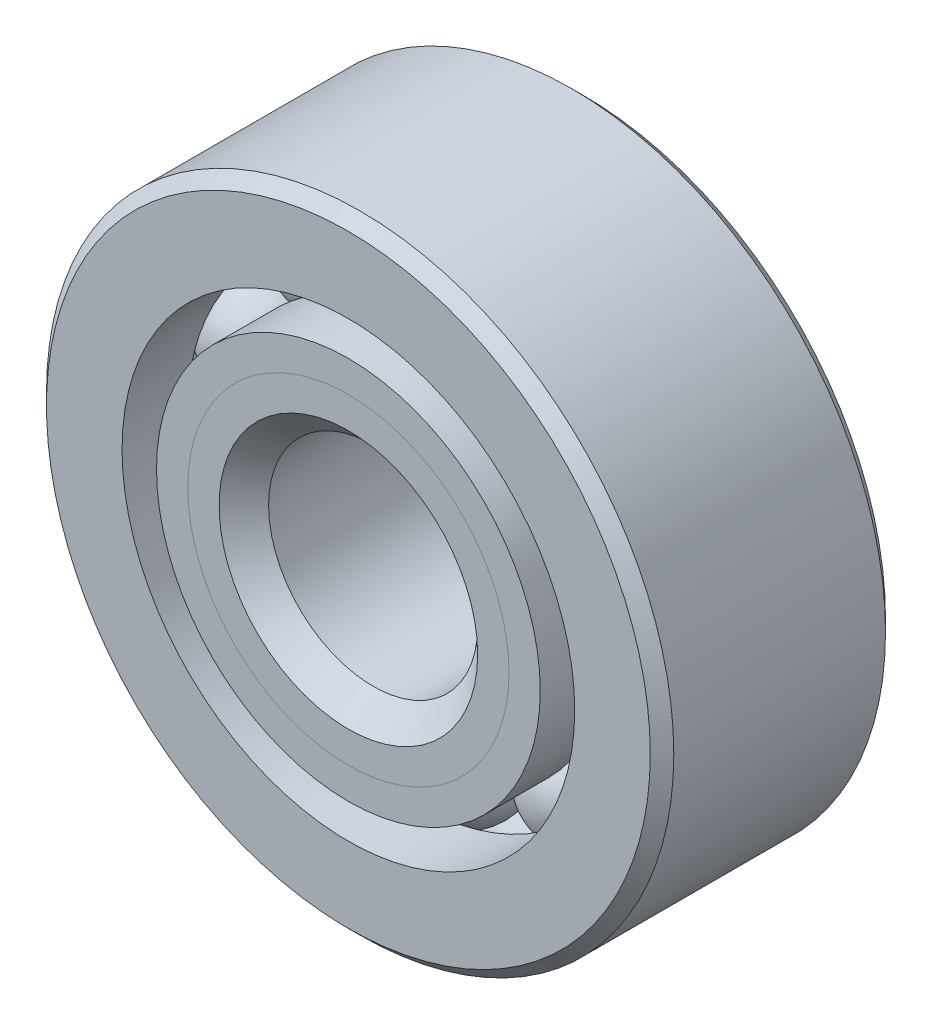
ISO-10303-21;
HEADER;
FILE_DESCRIPTION(('STEP AP214'),'2;1');
FILE_NAME('part.step','',(''),(''),'','','');
FILE_SCHEMA(('AUTOMOTIVE_DESIGN { 1 0 10303 214 1 1 1 1 }'));
ENDSEC;
DATA;
#1=APPLICATION_CONTEXT('core data for automotive mechanical design processes');
#2=APPLICATION_PROTOCOL_DEFINITION('international standard','automotive_design',2000,#1);
#3=PRODUCT_CONTEXT('',#1,'mechanical');
#4=PRODUCT('Part','Part','',(#3));
#5=PRODUCT_RELATED_PRODUCT_CATEGORY('part','',(#4));
#6=PRODUCT_DEFINITION_FORMATION('','',#4);
#7=PRODUCT_DEFINITION_CONTEXT('part definition',#1,'design');
#8=PRODUCT_DEFINITION('design','',#6,#7);
#9=PRODUCT_DEFINITION_SHAPE('','',#8);
#10=(LENGTH_UNIT() NAMED_UNIT(*) SI_UNIT(.MILLI.,.METRE.));
#11=(NAMED_UNIT(*) PLANE_ANGLE_UNIT() SI_UNIT($,.RADIAN.));
#12=(NAMED_UNIT(*) SI_UNIT($,.STERADIAN.) SOLID_ANGLE_UNIT());
#13=UNCERTAINTY_MEASURE_WITH_UNIT(LENGTH_MEASURE(1.E-05),#10,'distance_accuracy_value','');
#14=(GEOMETRIC_REPRESENTATION_CONTEXT(3) GLOBAL_UNCERTAINTY_ASSIGNED_CONTEXT((#13)) GLOBAL_UNIT_ASSIGNED_CONTEXT((#10,
#11,#12)) REPRESENTATION_CONTEXT('',''));
#15=CARTESIAN_POINT('',(0.,0.,0.));
#16=DIRECTION('',(0.,0.,1.));
#17=DIRECTION('',(1.,0.,0.));
#18=AXIS2_PLACEMENT_3D('',#15,#16,#17);
#19=CARTESIAN_POINT('',(-3.73243635205716,5.13725791428081,0.));
#20=DIRECTION('',(0.,0.,1.));
#21=DIRECTION('',(-0.587785252292462,0.809016994374955,0.));
#22=AXIS2_PLACEMENT_3D('',#19,#20,#21);
#23=SPHERICAL_SURFACE('',#22,1.67154216154795);
#24=CARTESIAN_POINT('',(-3.73243635205716,5.13725791428081,1.67154216154795));
#25=VERTEX_POINT('',#24);
#26=VERTEX_LOOP('',#25);
#27=FACE_BOUND('',#26,.T.);
#28=ADVANCED_FACE('F41',(#27),#23,.T.);
#29=CLOSED_SHELL('',(#28));
#30=MANIFOLD_SOLID_BREP('B2',#29);
#31=CARTESIAN_POINT('',(-6.03920887847421,1.96225791428098,0.));
#32=DIRECTION('',(0.,0.,1.));
#33=DIRECTION('',(-0.95105651629515,0.309016994374958,0.));
#34=AXIS2_PLACEMENT_3D('',#31,#32,#33);
#35=SPHERICAL_SURFACE('',#34,1.67154216154795);
#36=CARTESIAN_POINT('',(-6.03920887847421,1.96225791428098,1.67154216154795));
#37=VERTEX_POINT('',#36);
#38=VERTEX_LOOP('',#37);
#39=FACE_BOUND('',#38,.T.);
#40=ADVANCED_FACE('F110',(#39),#35,.T.);
#41=CLOSED_SHELL('',(#40));
#42=MANIFOLD_SOLID_BREP('B6',#41);
#43=CARTESIAN_POINT('',(-6.03920887847425,-1.96225791428085,6.66133814775094E-13));
#44=DIRECTION('',(0.,0.,1.));
#45=DIRECTION('',(-0.951056516295157,-0.309016994374938,0.));
#46=AXIS2_PLACEMENT_3D('',#43,#44,#45);
#47=SPHERICAL_SURFACE('',#46,1.67154216154795);
#48=CARTESIAN_POINT('',(-6.03920887847425,-1.96225791428085,1.67154216154861));
#49=VERTEX_POINT('',#48);
#50=VERTEX_LOOP('',#49);
#51=FACE_BOUND('',#50,.T.);
#52=ADVANCED_FACE('F179',(#51),#47,.T.);
#53=CLOSED_SHELL('',(#52));
#54=MANIFOLD_SOLID_BREP('B37',#53);
#55=CARTESIAN_POINT('',(-3.73243635205725,-5.13725791428103,6.52256026967279E-13));
#56=DIRECTION('',(0.,0.,1.));
#57=DIRECTION('',(-0.58778525229248,-0.809016994374942,0.));
#58=AXIS2_PLACEMENT_3D('',#55,#56,#57);
#59=SPHERICAL_SURFACE('',#58,1.67154216154795);
#60=CARTESIAN_POINT('',(-3.73243635205725,-5.13725791428103,1.6715421615486));
#61=VERTEX_POINT('',#60);
#62=VERTEX_LOOP('',#61);
#63=FACE_BOUND('',#62,.T.);
#64=ADVANCED_FACE('F248',(#63),#59,.T.);
#65=CLOSED_SHELL('',(#64));
#66=MANIFOLD_SOLID_BREP('B106',#65);
#67=CARTESIAN_POINT('',(0.,-6.34999999999999,0.));
#68=DIRECTION('',(0.,0.,1.));
#69=DIRECTION('',(0.,-1.,0.));
#70=AXIS2_PLACEMENT_3D('',#67,#68,#69);
#71=SPHERICAL_SURFACE('',#70,1.67154216154795);
#72=CARTESIAN_POINT('',(0.,-6.34999999999999,1.67154216154795));
#73=VERTEX_POINT('',#72);
#74=VERTEX_LOOP('',#73);
#75=FACE_BOUND('',#74,.T.);
#76=ADVANCED_FACE('F317',(#75),#71,.T.);
#77=CLOSED_SHELL('',(#76));
#78=MANIFOLD_SOLID_BREP('B175',#77);
#79=CARTESIAN_POINT('',(3.73243635205716,-5.13725791428094,6.52256026967279E-13));
#80=DIRECTION('',(0.,0.,1.));
#81=DIRECTION('',(0.587785252292469,-0.809016994374951,0.));
#82=AXIS2_PLACEMENT_3D('',#79,#80,#81);
#83=SPHERICAL_SURFACE('',#82,1.67154216154795);
#84=CARTESIAN_POINT('',(3.73243635205716,-5.13725791428094,1.6715421615486));
#85=VERTEX_POINT('',#84);
#86=VERTEX_LOOP('',#85);
#87=FACE_BOUND('',#86,.T.);
#88=ADVANCED_FACE('F386',(#87),#83,.T.);
#89=CLOSED_SHELL('',(#88));
#90=MANIFOLD_SOLID_BREP('B244',#89);
#91=CARTESIAN_POINT('',(6.03920887847421,-1.96225791428124,6.66133814775094E-13));
#92=DIRECTION('',(0.,0.,1.));
#93=DIRECTION('',(0.951056516295152,-0.309016994374952,0.));
#94=AXIS2_PLACEMENT_3D('',#91,#92,#93);
#95=SPHERICAL_SURFACE('',#94,1.67154216154795);
#96=CARTESIAN_POINT('',(6.03920887847421,-1.96225791428124,1.67154216154861));
#97=VERTEX_POINT('',#96);
#98=VERTEX_LOOP('',#97);
#99=FACE_BOUND('',#98,.T.);
#100=ADVANCED_FACE('F455',(#99),#95,.T.);
#101=CLOSED_SHELL('',(#100));
#102=MANIFOLD_SOLID_BREP('B313',#101);
#103=CARTESIAN_POINT('',(6.0392088784742,1.96225791428059,0.));
#104=DIRECTION('',(0.,0.,1.));
#105=DIRECTION('',(0.951056516295155,0.309016994374945,0.));
#106=AXIS2_PLACEMENT_3D('',#103,#104,#105);
#107=SPHERICAL_SURFACE('',#106,1.67154216154795);
#108=CARTESIAN_POINT('',(6.0392088784742,1.96225791428059,1.67154216154795));
#109=VERTEX_POINT('',#108);
#110=VERTEX_LOOP('',#109);
#111=FACE_BOUND('',#110,.T.);
#112=ADVANCED_FACE('F524',(#111),#107,.T.);
#113=CLOSED_SHELL('',(#112));
#114=MANIFOLD_SOLID_BREP('B382',#113);
#115=CARTESIAN_POINT('',(3.73243635205721,5.13725791428091,0.));
#116=DIRECTION('',(0.,0.,1.));
#117=DIRECTION('',(0.587785252292474,0.809016994374947,0.));
#118=AXIS2_PLACEMENT_3D('',#115,#116,#117);
#119=SPHERICAL_SURFACE('',#118,1.67154216154795);
#120=CARTESIAN_POINT('',(3.73243635205721,5.13725791428091,1.67154216154795));
#121=VERTEX_POINT('',#120);
#122=VERTEX_LOOP('',#121);
#123=FACE_BOUND('',#122,.T.);
#124=ADVANCED_FACE('F593',(#123),#119,.T.);
#125=CLOSED_SHELL('',(#124));
#126=MANIFOLD_SOLID_BREP('B451',#125);
#127=CARTESIAN_POINT('',(0.,6.34999999999999,6.93889390390723E-13));
#128=DIRECTION('',(0.,0.,1.));
#129=DIRECTION('',(0.,1.,0.));
#130=AXIS2_PLACEMENT_3D('',#127,#128,#129);
#131=SPHERICAL_SURFACE('',#130,1.67154216154795);
#132=CARTESIAN_POINT('',(0.,6.34999999999999,1.67154216154864));
#133=VERTEX_POINT('',#132);
#134=VERTEX_LOOP('',#133);
#135=FACE_BOUND('',#134,.T.);
#136=ADVANCED_FACE('F664',(#135),#131,.T.);
#137=CLOSED_SHELL('',(#136));
#138=MANIFOLD_SOLID_BREP('B520',#137);
#139=CARTESIAN_POINT('',(0.,4.87668863543704,3.57187499999999));
#140=DIRECTION('',(0.,0.,-1.));
#141=DIRECTION('',(-1.,0.,0.));
#142=AXIS2_PLACEMENT_3D('',#139,#140,#141);
#143=PLANE('',#142);
#144=CARTESIAN_POINT('',(0.,-1.52655665885959E-13,3.571875));
#145=DIRECTION('',(0.,0.,1.));
#146=DIRECTION('',(1.,0.,0.));
#147=AXIS2_PLACEMENT_3D('',#144,#145,#146);
#148=CIRCLE('',#147,3.92672891922603);
#149=CARTESIAN_POINT('',(3.92672891922603,-1.52655665885959E-13,3.571875));
#150=VERTEX_POINT('',#149);
#151=EDGE_CURVE('E718',#150,#150,#148,.T.);
#152=ORIENTED_EDGE('',*,*,#151,.F.);
#153=EDGE_LOOP('',(#152));
#154=FACE_BOUND('',#153,.T.);
#155=CARTESIAN_POINT('',(0.,-1.52655665885959E-13,3.571875));
#156=DIRECTION('',(0.,0.,1.));
#157=DIRECTION('',(1.,0.,0.));
#158=AXIS2_PLACEMENT_3D('',#155,#156,#157);
#159=CIRCLE('',#158,4.87668863543719);
#160=CARTESIAN_POINT('',(4.87668863543719,-1.52655665885959E-13,3.571875));
#161=VERTEX_POINT('',#160);
#162=EDGE_CURVE('E663',#161,#161,#159,.T.);
#163=ORIENTED_EDGE('',*,*,#162,.T.);
#164=EDGE_LOOP('',(#163));
#165=FACE_BOUND('',#164,.T.);
#166=ADVANCED_FACE('F684',(#154,#165),#143,.F.);
#167=CARTESIAN_POINT('',(0.,1.80411241501588E-13,2.62191528378883));
#168=DIRECTION('',(0.,0.,1.));
#169=DIRECTION('',(1.,0.,0.));
#170=AXIS2_PLACEMENT_3D('',#167,#168,#169);
#171=CONICAL_SURFACE('',#170,3.92672891922603,0.78539816339745);
#172=ORIENTED_EDGE('',*,*,#162,.F.);
#173=EDGE_LOOP('',(#172));
#174=FACE_BOUND('',#173,.T.);
#175=CARTESIAN_POINT('',(0.,1.80411241501588E-13,2.62191528378883));
#176=DIRECTION('',(0.,0.,1.));
#177=DIRECTION('',(1.,0.,0.));
#178=AXIS2_PLACEMENT_3D('',#175,#176,#177);
#179=CIRCLE('',#178,3.92672891922603);
#180=CARTESIAN_POINT('',(3.92672891922603,1.80411241501588E-13,2.62191528378883));
#181=VERTEX_POINT('',#180);
#182=EDGE_CURVE('E690',#181,#181,#179,.T.);
#183=ORIENTED_EDGE('',*,*,#182,.T.);
#184=EDGE_LOOP('',(#183));
#185=FACE_BOUND('',#184,.T.);
#186=ADVANCED_FACE('F725',(#174,#185),#171,.T.);
#187=CARTESIAN_POINT('',(0.,-1.52655665885959E-13,3.571875));
#188=DIRECTION('',(0.,0.,1.));
#189=DIRECTION('',(1.,0.,0.));
#190=AXIS2_PLACEMENT_3D('',#187,#188,#189);
#191=CYLINDRICAL_SURFACE('',#190,3.92672891922603);
#192=ORIENTED_EDGE('',*,*,#182,.F.);
#193=EDGE_LOOP('',(#192));
#194=FACE_BOUND('',#193,.T.);
#195=CARTESIAN_POINT('',(0.,0.,0.));
#196=DIRECTION('',(0.,0.,1.));
#197=DIRECTION('',(1.,0.,0.));
#198=AXIS2_PLACEMENT_3D('',#195,#196,#197);
#199=CIRCLE('',#198,3.92672891922603);
#200=CARTESIAN_POINT('',(3.92672891922603,0.,0.));
#201=VERTEX_POINT('',#200);
#202=EDGE_CURVE('E694',#201,#201,#199,.T.);
#203=ORIENTED_EDGE('',*,*,#202,.T.);
#204=EDGE_LOOP('',(#203));
#205=FACE_BOUND('',#204,.T.);
#206=ADVANCED_FACE('F729',(#194,#205),#191,.T.);
#207=CARTESIAN_POINT('',(0.,3.92672891922602,0.));
#208=DIRECTION('',(0.,0.,-1.));
#209=DIRECTION('',(-1.,0.,0.));
#210=AXIS2_PLACEMENT_3D('',#207,#208,#209);
#211=PLANE('',#210);
#212=ORIENTED_EDGE('',*,*,#202,.F.);
#213=EDGE_LOOP('',(#212));
#214=FACE_BOUND('',#213,.T.);
#215=CARTESIAN_POINT('',(0.,0.,0.));
#216=DIRECTION('',(0.,0.,1.));
#217=DIRECTION('',(1.,0.,0.));
#218=AXIS2_PLACEMENT_3D('',#215,#216,#217);
#219=CIRCLE('',#218,4.67845783845205);
#220=CARTESIAN_POINT('',(4.67845783845205,0.,0.));
#221=VERTEX_POINT('',#220);
#222=EDGE_CURVE('E698',#221,#221,#219,.T.);
#223=ORIENTED_EDGE('',*,*,#222,.T.);
#224=EDGE_LOOP('',(#223));
#225=FACE_BOUND('',#224,.T.);
#226=ADVANCED_FACE('F734',(#214,#225),#211,.F.);
#227=CARTESIAN_POINT('',(0.,0.,0.));
#228=DIRECTION('',(0.,0.,1.));
#229=DIRECTION('',(1.,0.,0.));
#230=AXIS2_PLACEMENT_3D('',#227,#228,#229);
#231=TOROIDAL_SURFACE('',#230,6.35,1.67154216154795);
#232=ORIENTED_EDGE('',*,*,#222,.F.);
#233=EDGE_LOOP('',(#232));
#234=FACE_BOUND('',#233,.T.);
#235=CARTESIAN_POINT('',(0.,0.,-1.58749999999996));
#236=DIRECTION('',(0.,0.,1.));
#237=DIRECTION('',(1.,0.,0.));
#238=AXIS2_PLACEMENT_3D('',#235,#236,#237);
#239=CIRCLE('',#238,5.82664835164835);
#240=CARTESIAN_POINT('',(5.82664835164835,0.,-1.58749999999996));
#241=VERTEX_POINT('',#240);
#242=EDGE_CURVE('E703',#241,#241,#239,.T.);
#243=ORIENTED_EDGE('',*,*,#242,.T.);
#244=EDGE_LOOP('',(#243));
#245=FACE_BOUND('',#244,.T.);
#246=ADVANCED_FACE('F740',(#234,#245),#231,.F.);
#247=CARTESIAN_POINT('',(0.,-1.52655665885959E-13,3.571875));
#248=DIRECTION('',(0.,0.,1.));
#249=DIRECTION('',(1.,0.,0.));
#250=AXIS2_PLACEMENT_3D('',#247,#248,#249);
#251=CYLINDRICAL_SURFACE('',#250,5.82664835164835);
#252=ORIENTED_EDGE('',*,*,#242,.F.);
#253=EDGE_LOOP('',(#252));
#254=FACE_BOUND('',#253,.T.);
#255=CARTESIAN_POINT('',(0.,0.,-3.57187499999997));
#256=DIRECTION('',(0.,0.,1.));
#257=DIRECTION('',(1.,0.,0.));
#258=AXIS2_PLACEMENT_3D('',#255,#256,#257);
#259=CIRCLE('',#258,5.82664835164835);
#260=CARTESIAN_POINT('',(5.82664835164835,0.,-3.57187499999997));
#261=VERTEX_POINT('',#260);
#262=EDGE_CURVE('E706',#261,#261,#259,.T.);
#263=ORIENTED_EDGE('',*,*,#262,.T.);
#264=EDGE_LOOP('',(#263));
#265=FACE_BOUND('',#264,.T.);
#266=ADVANCED_FACE('F744',(#254,#265),#251,.T.);
#267=CARTESIAN_POINT('',(0.,3.53218750000002,-3.57187499999997));
#268=DIRECTION('',(0.,0.,1.));
#269=DIRECTION('',(1.,0.,0.));
#270=AXIS2_PLACEMENT_3D('',#267,#268,#269);
#271=PLANE('',#270);
#272=ORIENTED_EDGE('',*,*,#262,.F.);
#273=EDGE_LOOP('',(#272));
#274=FACE_BOUND('',#273,.T.);
#275=CARTESIAN_POINT('',(0.,0.,-3.57187499999997));
#276=DIRECTION('',(0.,0.,1.));
#277=DIRECTION('',(1.,0.,0.));
#278=AXIS2_PLACEMENT_3D('',#275,#276,#277);
#279=CIRCLE('',#278,3.5321875);
#280=CARTESIAN_POINT('',(3.5321875,0.,-3.57187499999997));
#281=VERTEX_POINT('',#280);
#282=EDGE_CURVE('E709',#281,#281,#279,.T.);
#283=ORIENTED_EDGE('',*,*,#282,.T.);
#284=EDGE_LOOP('',(#283));
#285=FACE_BOUND('',#284,.T.);
#286=ADVANCED_FACE('F748',(#274,#285),#271,.F.);
#287=CARTESIAN_POINT('',(0.,1.94289029309402E-13,-3.21468749999998));
#288=DIRECTION('',(0.,0.,-1.));
#289=DIRECTION('',(-1.,0.,0.));
#290=AXIS2_PLACEMENT_3D('',#287,#288,#289);
#291=CONICAL_SURFACE('',#290,3.175,0.785398163397446);
#292=ORIENTED_EDGE('',*,*,#282,.F.);
#293=EDGE_LOOP('',(#292));
#294=FACE_BOUND('',#293,.T.);
#295=CARTESIAN_POINT('',(0.,1.94289029309402E-13,-3.21468749999998));
#296=DIRECTION('',(0.,0.,1.));
#297=DIRECTION('',(1.,0.,0.));
#298=AXIS2_PLACEMENT_3D('',#295,#296,#297);
#299=CIRCLE('',#298,3.175);
#300=CARTESIAN_POINT('',(3.175,1.94289029309402E-13,-3.21468749999998));
#301=VERTEX_POINT('',#300);
#302=EDGE_CURVE('E712',#301,#301,#299,.T.);
#303=ORIENTED_EDGE('',*,*,#302,.T.);
#304=EDGE_LOOP('',(#303));
#305=FACE_BOUND('',#304,.T.);
#306=ADVANCED_FACE('F752',(#294,#305),#291,.F.);
#307=CARTESIAN_POINT('',(0.,-1.52655665885959E-13,3.571875));
#308=DIRECTION('',(0.,0.,1.));
#309=DIRECTION('',(1.,0.,0.));
#310=AXIS2_PLACEMENT_3D('',#307,#308,#309);
#311=CYLINDRICAL_SURFACE('',#310,3.175);
#312=ORIENTED_EDGE('',*,*,#302,.F.);
#313=EDGE_LOOP('',(#312));
#314=FACE_BOUND('',#313,.T.);
#315=CARTESIAN_POINT('',(0.,1.94289029309402E-13,2.82014608077397));
#316=DIRECTION('',(0.,0.,1.));
#317=DIRECTION('',(1.,0.,0.));
#318=AXIS2_PLACEMENT_3D('',#315,#316,#317);
#319=CIRCLE('',#318,3.175);
#320=CARTESIAN_POINT('',(3.175,1.94289029309402E-13,2.82014608077397));
#321=VERTEX_POINT('',#320);
#322=EDGE_CURVE('E715',#321,#321,#319,.T.);
#323=ORIENTED_EDGE('',*,*,#322,.T.);
#324=EDGE_LOOP('',(#323));
#325=FACE_BOUND('',#324,.T.);
#326=ADVANCED_FACE('F756',(#314,#325),#311,.F.);
#327=CARTESIAN_POINT('',(0.,-1.52655665885959E-13,3.571875));
#328=DIRECTION('',(0.,0.,1.));
#329=DIRECTION('',(1.,0.,0.));
#330=AXIS2_PLACEMENT_3D('',#327,#328,#329);
#331=CONICAL_SURFACE('',#330,3.92672891922603,0.78539816339745);
#332=ORIENTED_EDGE('',*,*,#322,.F.);
#333=EDGE_LOOP('',(#332));
#334=FACE_BOUND('',#333,.T.);
#335=ORIENTED_EDGE('',*,*,#151,.T.);
#336=EDGE_LOOP('',(#335));
#337=FACE_BOUND('',#336,.T.);
#338=ADVANCED_FACE('F722',(#334,#337),#331,.F.);
#339=CLOSED_SHELL('',(#166,#186,#206,#226,#246,#266,#286,#306,#326,#338));
#340=MANIFOLD_SOLID_BREP('B589',#339);
#341=CARTESIAN_POINT('',(0.,5.8266483516482,3.571875));
#342=DIRECTION('',(0.,0.,-1.));
#343=DIRECTION('',(-1.,0.,0.));
#344=AXIS2_PLACEMENT_3D('',#341,#342,#343);
#345=PLANE('',#344);
#346=CARTESIAN_POINT('',(0.,-1.52655665885959E-13,3.571875));
#347=DIRECTION('',(0.,0.,1.));
#348=DIRECTION('',(1.,0.,0.));
#349=AXIS2_PLACEMENT_3D('',#346,#347,#348);
#350=CIRCLE('',#349,4.87668863543719);
#351=CARTESIAN_POINT('',(4.87668863543719,-1.52655665885959E-13,3.571875));
#352=VERTEX_POINT('',#351);
#353=EDGE_CURVE('E683',#352,#352,#350,.T.);
#354=ORIENTED_EDGE('',*,*,#353,.F.);
#355=EDGE_LOOP('',(#354));
#356=FACE_BOUND('',#355,.T.);
#357=CARTESIAN_POINT('',(0.,-1.52655665885959E-13,3.571875));
#358=DIRECTION('',(0.,0.,1.));
#359=DIRECTION('',(1.,0.,0.));
#360=AXIS2_PLACEMENT_3D('',#357,#358,#359);
#361=CIRCLE('',#360,5.82664835164835);
#362=CARTESIAN_POINT('',(5.82664835164835,-1.52655665885959E-13,3.571875));
#363=VERTEX_POINT('',#362);
#364=EDGE_CURVE('E864',#363,#363,#361,.T.);
#365=ORIENTED_EDGE('',*,*,#364,.T.);
#366=EDGE_LOOP('',(#365));
#367=FACE_BOUND('',#366,.T.);
#368=ADVANCED_FACE('F842',(#356,#367),#345,.F.);
#369=CARTESIAN_POINT('',(0.,-1.52655665885959E-13,3.571875));
#370=DIRECTION('',(0.,0.,1.));
#371=DIRECTION('',(1.,0.,0.));
#372=AXIS2_PLACEMENT_3D('',#369,#370,#371);
#373=CONICAL_SURFACE('',#372,4.87668863543719,0.78539816339745);
#374=CARTESIAN_POINT('',(0.,1.80411241501588E-13,2.62191528378883));
#375=DIRECTION('',(0.,0.,1.));
#376=DIRECTION('',(1.,0.,0.));
#377=AXIS2_PLACEMENT_3D('',#374,#375,#376);
#378=CIRCLE('',#377,3.92672891922603);
#379=CARTESIAN_POINT('',(3.92672891922603,1.80411241501588E-13,2.62191528378883));
#380=VERTEX_POINT('',#379);
#381=EDGE_CURVE('E848',#380,#380,#378,.T.);
#382=ORIENTED_EDGE('',*,*,#381,.F.);
#383=EDGE_LOOP('',(#382));
#384=FACE_BOUND('',#383,.T.);
#385=ORIENTED_EDGE('',*,*,#353,.T.);
#386=EDGE_LOOP('',(#385));
#387=FACE_BOUND('',#386,.T.);
#388=ADVANCED_FACE('F889',(#384,#387),#373,.F.);
#389=CARTESIAN_POINT('',(0.,-1.52655665885959E-13,3.571875));
#390=DIRECTION('',(0.,0.,1.));
#391=DIRECTION('',(1.,0.,0.));
#392=AXIS2_PLACEMENT_3D('',#389,#390,#391);
#393=CYLINDRICAL_SURFACE('',#392,3.92672891922603);
#394=CARTESIAN_POINT('',(0.,0.,0.));
#395=DIRECTION('',(0.,0.,1.));
#396=DIRECTION('',(1.,0.,0.));
#397=AXIS2_PLACEMENT_3D('',#394,#395,#396);
#398=CIRCLE('',#397,3.92672891922603);
#399=CARTESIAN_POINT('',(3.92672891922603,0.,0.));
#400=VERTEX_POINT('',#399);
#401=EDGE_CURVE('E852',#400,#400,#398,.T.);
#402=ORIENTED_EDGE('',*,*,#401,.F.);
#403=EDGE_LOOP('',(#402));
#404=FACE_BOUND('',#403,.T.);
#405=ORIENTED_EDGE('',*,*,#381,.T.);
#406=EDGE_LOOP('',(#405));
#407=FACE_BOUND('',#406,.T.);
#408=ADVANCED_FACE('F884',(#404,#407),#393,.F.);
#409=CARTESIAN_POINT('',(0.,3.92672891922602,0.));
#410=DIRECTION('',(0.,0.,1.));
#411=DIRECTION('',(1.,0.,0.));
#412=AXIS2_PLACEMENT_3D('',#409,#410,#411);
#413=PLANE('',#412);
#414=CARTESIAN_POINT('',(0.,0.,0.));
#415=DIRECTION('',(0.,0.,1.));
#416=DIRECTION('',(1.,0.,0.));
#417=AXIS2_PLACEMENT_3D('',#414,#415,#416);
#418=CIRCLE('',#417,4.67845783845205);
#419=CARTESIAN_POINT('',(4.67845783845205,0.,0.));
#420=VERTEX_POINT('',#419);
#421=EDGE_CURVE('E856',#420,#420,#418,.T.);
#422=ORIENTED_EDGE('',*,*,#421,.F.);
#423=EDGE_LOOP('',(#422));
#424=FACE_BOUND('',#423,.T.);
#425=ORIENTED_EDGE('',*,*,#401,.T.);
#426=EDGE_LOOP('',(#425));
#427=FACE_BOUND('',#426,.T.);
#428=ADVANCED_FACE('F878',(#424,#427),#413,.F.);
#429=CARTESIAN_POINT('',(0.,0.,0.));
#430=DIRECTION('',(0.,0.,1.));
#431=DIRECTION('',(1.,0.,0.));
#432=AXIS2_PLACEMENT_3D('',#429,#430,#431);
#433=TOROIDAL_SURFACE('',#432,6.35,1.67154216154795);
#434=CARTESIAN_POINT('',(0.,0.,1.58749999999999));
#435=DIRECTION('',(0.,0.,1.));
#436=DIRECTION('',(1.,0.,0.));
#437=AXIS2_PLACEMENT_3D('',#434,#435,#436);
#438=CIRCLE('',#437,5.82664835164835);
#439=CARTESIAN_POINT('',(5.82664835164835,0.,1.58749999999999));
#440=VERTEX_POINT('',#439);
#441=EDGE_CURVE('E861',#440,#440,#438,.T.);
#442=ORIENTED_EDGE('',*,*,#441,.F.);
#443=EDGE_LOOP('',(#442));
#444=FACE_BOUND('',#443,.T.);
#445=ORIENTED_EDGE('',*,*,#421,.T.);
#446=EDGE_LOOP('',(#445));
#447=FACE_BOUND('',#446,.T.);
#448=ADVANCED_FACE('F872',(#444,#447),#433,.F.);
#449=CARTESIAN_POINT('',(0.,-1.52655665885959E-13,3.571875));
#450=DIRECTION('',(0.,0.,1.));
#451=DIRECTION('',(1.,0.,0.));
#452=AXIS2_PLACEMENT_3D('',#449,#450,#451);
#453=CYLINDRICAL_SURFACE('',#452,5.82664835164835);
#454=ORIENTED_EDGE('',*,*,#364,.F.);
#455=EDGE_LOOP('',(#454));
#456=FACE_BOUND('',#455,.T.);
#457=ORIENTED_EDGE('',*,*,#441,.T.);
#458=EDGE_LOOP('',(#457));
#459=FACE_BOUND('',#458,.T.);
#460=ADVANCED_FACE('F869',(#456,#459),#453,.T.);
#461=CLOSED_SHELL('',(#368,#388,#408,#428,#448,#460));
#462=MANIFOLD_SOLID_BREP('B658',#461);
#463=CARTESIAN_POINT('',(0.,-1.52655665885959E-13,3.21468750000001));
#464=DIRECTION('',(0.,0.,-1.));
#465=DIRECTION('',(-1.,0.,0.));
#466=AXIS2_PLACEMENT_3D('',#463,#464,#465);
#467=CONICAL_SURFACE('',#466,9.525,0.785398163397446);
#468=CARTESIAN_POINT('',(0.,-1.52655665885959E-13,3.571875));
#469=DIRECTION('',(0.,0.,1.));
#470=DIRECTION('',(1.,0.,0.));
#471=AXIS2_PLACEMENT_3D('',#468,#469,#470);
#472=CIRCLE('',#471,9.1678125);
#473=CARTESIAN_POINT('',(9.1678125,-1.52655665885959E-13,3.571875));
#474=VERTEX_POINT('',#473);
#475=EDGE_CURVE('E961',#474,#474,#472,.T.);
#476=ORIENTED_EDGE('',*,*,#475,.F.);
#477=EDGE_LOOP('',(#476));
#478=FACE_BOUND('',#477,.T.);
#479=CARTESIAN_POINT('',(0.,-1.52655665885959E-13,3.21468750000001));
#480=DIRECTION('',(0.,0.,1.));
#481=DIRECTION('',(1.,0.,0.));
#482=AXIS2_PLACEMENT_3D('',#479,#480,#481);
#483=CIRCLE('',#482,9.525);
#484=CARTESIAN_POINT('',(9.525,-1.52655665885959E-13,3.21468750000001));
#485=VERTEX_POINT('',#484);
#486=EDGE_CURVE('E841',#485,#485,#483,.T.);
#487=ORIENTED_EDGE('',*,*,#486,.T.);
#488=EDGE_LOOP('',(#487));
#489=FACE_BOUND('',#488,.T.);
#490=ADVANCED_FACE('F933',(#478,#489),#467,.T.);
#491=CARTESIAN_POINT('',(0.,-1.52655665885959E-13,3.571875));
#492=DIRECTION('',(0.,0.,1.));
#493=DIRECTION('',(1.,0.,0.));
#494=AXIS2_PLACEMENT_3D('',#491,#492,#493);
#495=CYLINDRICAL_SURFACE('',#494,9.525);
#496=ORIENTED_EDGE('',*,*,#486,.F.);
#497=EDGE_LOOP('',(#496));
#498=FACE_BOUND('',#497,.T.);
#499=CARTESIAN_POINT('',(0.,1.94289029309402E-13,-3.21468749999998));
#500=DIRECTION('',(0.,0.,1.));
#501=DIRECTION('',(1.,0.,0.));
#502=AXIS2_PLACEMENT_3D('',#499,#500,#501);
#503=CIRCLE('',#502,9.525);
#504=CARTESIAN_POINT('',(9.525,1.94289029309402E-13,-3.21468749999998));
#505=VERTEX_POINT('',#504);
#506=EDGE_CURVE('E939',#505,#505,#503,.T.);
#507=ORIENTED_EDGE('',*,*,#506,.T.);
#508=EDGE_LOOP('',(#507));
#509=FACE_BOUND('',#508,.T.);
#510=ADVANCED_FACE('F968',(#498,#509),#495,.T.);
#511=CARTESIAN_POINT('',(0.,0.,-3.57187499999997));
#512=DIRECTION('',(0.,0.,1.));
#513=DIRECTION('',(1.,0.,0.));
#514=AXIS2_PLACEMENT_3D('',#511,#512,#513);
#515=CONICAL_SURFACE('',#514,9.1678125,0.785398163397441);
#516=ORIENTED_EDGE('',*,*,#506,.F.);
#517=EDGE_LOOP('',(#516));
#518=FACE_BOUND('',#517,.T.);
#519=CARTESIAN_POINT('',(0.,0.,-3.57187499999997));
#520=DIRECTION('',(0.,0.,1.));
#521=DIRECTION('',(1.,0.,0.));
#522=AXIS2_PLACEMENT_3D('',#519,#520,#521);
#523=CIRCLE('',#522,9.1678125);
#524=CARTESIAN_POINT('',(9.1678125,0.,-3.57187499999997));
#525=VERTEX_POINT('',#524);
#526=EDGE_CURVE('E943',#525,#525,#523,.T.);
#527=ORIENTED_EDGE('',*,*,#526,.T.);
#528=EDGE_LOOP('',(#527));
#529=FACE_BOUND('',#528,.T.);
#530=ADVANCED_FACE('F972',(#518,#529),#515,.T.);
#531=CARTESIAN_POINT('',(0.,9.16781250000003,-3.57187499999997));
#532=DIRECTION('',(0.,0.,1.));
#533=DIRECTION('',(1.,0.,0.));
#534=AXIS2_PLACEMENT_3D('',#531,#532,#533);
#535=PLANE('',#534);
#536=ORIENTED_EDGE('',*,*,#526,.F.);
#537=EDGE_LOOP('',(#536));
#538=FACE_BOUND('',#537,.T.);
#539=CARTESIAN_POINT('',(0.,0.,-3.57187499999997));
#540=DIRECTION('',(0.,0.,1.));
#541=DIRECTION('',(1.,0.,0.));
#542=AXIS2_PLACEMENT_3D('',#539,#540,#541);
#543=CIRCLE('',#542,6.87335164835165);
#544=CARTESIAN_POINT('',(6.87335164835165,0.,-3.57187499999997));
#545=VERTEX_POINT('',#544);
#546=EDGE_CURVE('E947',#545,#545,#543,.T.);
#547=ORIENTED_EDGE('',*,*,#546,.T.);
#548=EDGE_LOOP('',(#547));
#549=FACE_BOUND('',#548,.T.);
#550=ADVANCED_FACE('F977',(#538,#549),#535,.F.);
#551=CARTESIAN_POINT('',(0.,-1.52655665885959E-13,3.571875));
#552=DIRECTION('',(0.,0.,1.));
#553=DIRECTION('',(1.,0.,0.));
#554=AXIS2_PLACEMENT_3D('',#551,#552,#553);
#555=CYLINDRICAL_SURFACE('',#554,6.87335164835165);
#556=ORIENTED_EDGE('',*,*,#546,.F.);
#557=EDGE_LOOP('',(#556));
#558=FACE_BOUND('',#557,.T.);
#559=CARTESIAN_POINT('',(0.,0.,-1.58749999999996));
#560=DIRECTION('',(0.,0.,1.));
#561=DIRECTION('',(1.,0.,0.));
#562=AXIS2_PLACEMENT_3D('',#559,#560,#561);
#563=CIRCLE('',#562,6.87335164835165);
#564=CARTESIAN_POINT('',(6.87335164835165,0.,-1.58749999999996));
#565=VERTEX_POINT('',#564);
#566=EDGE_CURVE('E952',#565,#565,#563,.T.);
#567=ORIENTED_EDGE('',*,*,#566,.T.);
#568=EDGE_LOOP('',(#567));
#569=FACE_BOUND('',#568,.T.);
#570=ADVANCED_FACE('F983',(#558,#569),#555,.F.);
#571=CARTESIAN_POINT('',(0.,0.,0.));
#572=DIRECTION('',(0.,0.,1.));
#573=DIRECTION('',(1.,0.,0.));
#574=AXIS2_PLACEMENT_3D('',#571,#572,#573);
#575=TOROIDAL_SURFACE('',#574,6.35,1.67154216154795);
#576=ORIENTED_EDGE('',*,*,#566,.F.);
#577=EDGE_LOOP('',(#576));
#578=FACE_BOUND('',#577,.T.);
#579=CARTESIAN_POINT('',(0.,0.,1.58749999999999));
#580=DIRECTION('',(0.,0.,1.));
#581=DIRECTION('',(1.,0.,0.));
#582=AXIS2_PLACEMENT_3D('',#579,#580,#581);
#583=CIRCLE('',#582,6.87335164835165);
#584=CARTESIAN_POINT('',(6.87335164835165,0.,1.58749999999999));
#585=VERTEX_POINT('',#584);
#586=EDGE_CURVE('E955',#585,#585,#583,.T.);
#587=ORIENTED_EDGE('',*,*,#586,.T.);
#588=EDGE_LOOP('',(#587));
#589=FACE_BOUND('',#588,.T.);
#590=ADVANCED_FACE('F987',(#578,#589),#575,.F.);
#591=CARTESIAN_POINT('',(0.,-1.52655665885959E-13,3.571875));
#592=DIRECTION('',(0.,0.,1.));
#593=DIRECTION('',(1.,0.,0.));
#594=AXIS2_PLACEMENT_3D('',#591,#592,#593);
#595=CYLINDRICAL_SURFACE('',#594,6.87335164835165);
#596=ORIENTED_EDGE('',*,*,#586,.F.);
#597=EDGE_LOOP('',(#596));
#598=FACE_BOUND('',#597,.T.);
#599=CARTESIAN_POINT('',(0.,-1.52655665885959E-13,3.571875));
#600=DIRECTION('',(0.,0.,1.));
#601=DIRECTION('',(1.,0.,0.));
#602=AXIS2_PLACEMENT_3D('',#599,#600,#601);
#603=CIRCLE('',#602,6.87335164835165);
#604=CARTESIAN_POINT('',(6.87335164835165,-1.52655665885959E-13,3.571875));
#605=VERTEX_POINT('',#604);
#606=EDGE_CURVE('E958',#605,#605,#603,.T.);
#607=ORIENTED_EDGE('',*,*,#606,.T.);
#608=EDGE_LOOP('',(#607));
#609=FACE_BOUND('',#608,.T.);
#610=ADVANCED_FACE('F991',(#598,#609),#595,.F.);
#611=CARTESIAN_POINT('',(0.,9.16781249999986,3.571875));
#612=DIRECTION('',(0.,0.,-1.));
#613=DIRECTION('',(-1.,0.,0.));
#614=AXIS2_PLACEMENT_3D('',#611,#612,#613);
#615=PLANE('',#614);
#616=ORIENTED_EDGE('',*,*,#606,.F.);
#617=EDGE_LOOP('',(#616));
#618=FACE_BOUND('',#617,.T.);
#619=ORIENTED_EDGE('',*,*,#475,.T.);
#620=EDGE_LOOP('',(#619));
#621=FACE_BOUND('',#620,.T.);
#622=ADVANCED_FACE('F965',(#618,#621),#615,.F.);
#623=CLOSED_SHELL('',(#490,#510,#530,#550,#570,#590,#610,#622));
#624=MANIFOLD_SOLID_BREP('B678',#623);
#625=ADVANCED_BREP_SHAPE_REPRESENTATION('',(#18,#30,#42,#54,#66,#78,#90,#102,#114,#126,#138,
#340,#462,#624),#14);
#626=SHAPE_DEFINITION_REPRESENTATION(#9,#625);
ENDSEC;
END-ISO-10303-21;
